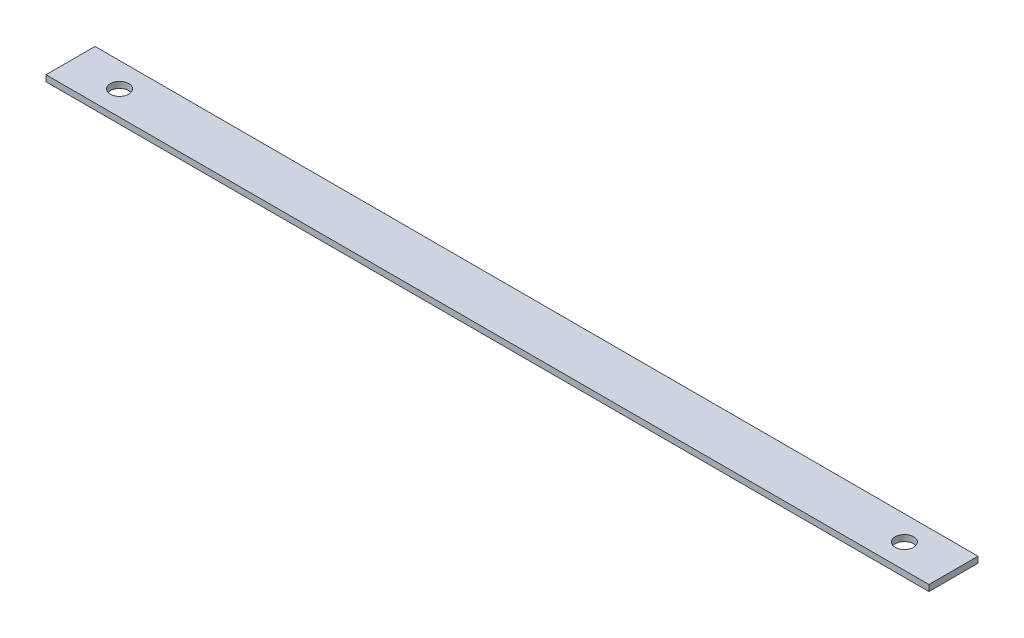
ISO-10303-21;
HEADER;
FILE_DESCRIPTION(('STEP AP214'),'2;1');
FILE_NAME('part.step','',(''),(''),'','','');
FILE_SCHEMA(('AUTOMOTIVE_DESIGN { 1 0 10303 214 1 1 1 1 }'));
ENDSEC;
DATA;
#1=APPLICATION_CONTEXT('core data for automotive mechanical design processes');
#2=APPLICATION_PROTOCOL_DEFINITION('international standard','automotive_design',2000,#1);
#3=PRODUCT_CONTEXT('',#1,'mechanical');
#4=PRODUCT('Part','Part','',(#3));
#5=PRODUCT_RELATED_PRODUCT_CATEGORY('part','',(#4));
#6=PRODUCT_DEFINITION_FORMATION('','',#4);
#7=PRODUCT_DEFINITION_CONTEXT('part definition',#1,'design');
#8=PRODUCT_DEFINITION('design','',#6,#7);
#9=PRODUCT_DEFINITION_SHAPE('','',#8);
#10=(LENGTH_UNIT() NAMED_UNIT(*) SI_UNIT(.MILLI.,.METRE.));
#11=(NAMED_UNIT(*) PLANE_ANGLE_UNIT() SI_UNIT($,.RADIAN.));
#12=(NAMED_UNIT(*) SI_UNIT($,.STERADIAN.) SOLID_ANGLE_UNIT());
#13=UNCERTAINTY_MEASURE_WITH_UNIT(LENGTH_MEASURE(1.E-05),#10,'distance_accuracy_value','');
#14=(GEOMETRIC_REPRESENTATION_CONTEXT(3) GLOBAL_UNCERTAINTY_ASSIGNED_CONTEXT((#13)) GLOBAL_UNIT_ASSIGNED_CONTEXT((#10,
#11,#12)) REPRESENTATION_CONTEXT('',''));
#15=CARTESIAN_POINT('',(0.,0.,0.));
#16=DIRECTION('',(0.,0.,1.));
#17=DIRECTION('',(1.,0.,0.));
#18=AXIS2_PLACEMENT_3D('',#15,#16,#17);
#19=CARTESIAN_POINT('',(-228.6,3.175,12.7));
#20=DIRECTION('',(1.,0.,0.));
#21=DIRECTION('',(0.,0.,-1.));
#22=AXIS2_PLACEMENT_3D('',#19,#20,#21);
#23=PLANE('',#22);
#24=DIRECTION('',(0.,0.,1.));
#25=VECTOR('',#24,1.);
#26=CARTESIAN_POINT('',(-228.6,0.,12.7));
#27=LINE('',#26,#25);
#28=CARTESIAN_POINT('',(-228.6,0.,-12.7));
#29=VERTEX_POINT('',#28);
#30=CARTESIAN_POINT('',(-228.6,0.,12.7));
#31=VERTEX_POINT('',#30);
#32=EDGE_CURVE('E99',#29,#31,#27,.T.);
#33=ORIENTED_EDGE('',*,*,#32,.T.);
#34=DIRECTION('',(0.,-1.,0.));
#35=VECTOR('',#34,1.);
#36=CARTESIAN_POINT('',(-228.6,3.175,12.7));
#37=LINE('',#36,#35);
#38=CARTESIAN_POINT('',(-228.6,3.175,12.7));
#39=VERTEX_POINT('',#38);
#40=EDGE_CURVE('E11',#39,#31,#37,.T.);
#41=ORIENTED_EDGE('',*,*,#40,.F.);
#42=DIRECTION('',(0.,0.,1.));
#43=VECTOR('',#42,1.);
#44=CARTESIAN_POINT('',(-228.6,3.175,12.7));
#45=LINE('',#44,#43);
#46=CARTESIAN_POINT('',(-228.6,3.175,-12.7));
#47=VERTEX_POINT('',#46);
#48=EDGE_CURVE('E87',#47,#39,#45,.T.);
#49=ORIENTED_EDGE('',*,*,#48,.F.);
#50=DIRECTION('',(0.,-1.,0.));
#51=VECTOR('',#50,1.);
#52=CARTESIAN_POINT('',(-228.6,3.175,-12.7));
#53=LINE('',#52,#51);
#54=EDGE_CURVE('E95',#47,#29,#53,.T.);
#55=ORIENTED_EDGE('',*,*,#54,.T.);
#56=EDGE_LOOP('',(#33,#41,#49,#55));
#57=FACE_BOUND('',#56,.T.);
#58=ADVANCED_FACE('F36',(#57),#23,.F.);
#59=CARTESIAN_POINT('',(228.6,3.175,12.7));
#60=DIRECTION('',(0.,0.,-1.));
#61=DIRECTION('',(-1.,0.,0.));
#62=AXIS2_PLACEMENT_3D('',#59,#60,#61);
#63=PLANE('',#62);
#64=DIRECTION('',(1.,0.,0.));
#65=VECTOR('',#64,1.);
#66=CARTESIAN_POINT('',(228.6,0.,12.7));
#67=LINE('',#66,#65);
#68=CARTESIAN_POINT('',(228.6,0.,12.7));
#69=VERTEX_POINT('',#68);
#70=EDGE_CURVE('E91',#31,#69,#67,.T.);
#71=ORIENTED_EDGE('',*,*,#70,.T.);
#72=DIRECTION('',(0.,-1.,0.));
#73=VECTOR('',#72,1.);
#74=CARTESIAN_POINT('',(228.6,3.175,12.7));
#75=LINE('',#74,#73);
#76=CARTESIAN_POINT('',(228.6,3.175,12.7));
#77=VERTEX_POINT('',#76);
#78=EDGE_CURVE('E44',#77,#69,#75,.T.);
#79=ORIENTED_EDGE('',*,*,#78,.F.);
#80=DIRECTION('',(1.,0.,0.));
#81=VECTOR('',#80,1.);
#82=CARTESIAN_POINT('',(228.6,3.175,12.7));
#83=LINE('',#82,#81);
#84=EDGE_CURVE('E82',#39,#77,#83,.T.);
#85=ORIENTED_EDGE('',*,*,#84,.F.);
#86=ORIENTED_EDGE('',*,*,#40,.T.);
#87=EDGE_LOOP('',(#71,#79,#85,#86));
#88=FACE_BOUND('',#87,.T.);
#89=ADVANCED_FACE('F90',(#88),#63,.F.);
#90=CARTESIAN_POINT('',(228.6,3.175,12.7));
#91=DIRECTION('',(-1.,0.,0.));
#92=DIRECTION('',(0.,0.,1.));
#93=AXIS2_PLACEMENT_3D('',#90,#91,#92);
#94=PLANE('',#93);
#95=DIRECTION('',(0.,0.,-1.));
#96=VECTOR('',#95,1.);
#97=CARTESIAN_POINT('',(228.6,0.,12.7));
#98=LINE('',#97,#96);
#99=CARTESIAN_POINT('',(228.6,0.,-12.7));
#100=VERTEX_POINT('',#99);
#101=EDGE_CURVE('E69',#69,#100,#98,.T.);
#102=ORIENTED_EDGE('',*,*,#101,.T.);
#103=DIRECTION('',(0.,-1.,0.));
#104=VECTOR('',#103,1.);
#105=CARTESIAN_POINT('',(228.6,3.175,-12.7));
#106=LINE('',#105,#104);
#107=CARTESIAN_POINT('',(228.6,3.175,-12.7));
#108=VERTEX_POINT('',#107);
#109=EDGE_CURVE('E92',#108,#100,#106,.T.);
#110=ORIENTED_EDGE('',*,*,#109,.F.);
#111=DIRECTION('',(0.,0.,-1.));
#112=VECTOR('',#111,1.);
#113=CARTESIAN_POINT('',(228.6,3.175,12.7));
#114=LINE('',#113,#112);
#115=EDGE_CURVE('E85',#77,#108,#114,.T.);
#116=ORIENTED_EDGE('',*,*,#115,.F.);
#117=ORIENTED_EDGE('',*,*,#78,.T.);
#118=EDGE_LOOP('',(#102,#110,#116,#117));
#119=FACE_BOUND('',#118,.T.);
#120=ADVANCED_FACE('F93',(#119),#94,.F.);
#121=CARTESIAN_POINT('',(228.6,3.175,-12.7));
#122=DIRECTION('',(0.,0.,1.));
#123=DIRECTION('',(1.,0.,0.));
#124=AXIS2_PLACEMENT_3D('',#121,#122,#123);
#125=PLANE('',#124);
#126=DIRECTION('',(-1.,0.,0.));
#127=VECTOR('',#126,1.);
#128=CARTESIAN_POINT('',(228.6,0.,-12.7));
#129=LINE('',#128,#127);
#130=EDGE_CURVE('E75',#100,#29,#129,.T.);
#131=ORIENTED_EDGE('',*,*,#130,.T.);
#132=ORIENTED_EDGE('',*,*,#54,.F.);
#133=DIRECTION('',(-1.,0.,0.));
#134=VECTOR('',#133,1.);
#135=CARTESIAN_POINT('',(228.6,3.175,-12.7));
#136=LINE('',#135,#134);
#137=EDGE_CURVE('E52',#108,#47,#136,.T.);
#138=ORIENTED_EDGE('',*,*,#137,.F.);
#139=ORIENTED_EDGE('',*,*,#109,.T.);
#140=EDGE_LOOP('',(#131,#132,#138,#139));
#141=FACE_BOUND('',#140,.T.);
#142=ADVANCED_FACE('F107',(#141),#125,.F.);
#143=CARTESIAN_POINT('',(0.,3.175,0.));
#144=DIRECTION('',(0.,1.,0.));
#145=DIRECTION('',(0.,0.,1.));
#146=AXIS2_PLACEMENT_3D('',#143,#144,#145);
#147=PLANE('',#146);
#148=CARTESIAN_POINT('',(-203.2,3.175,0.));
#149=DIRECTION('',(0.,1.,0.));
#150=DIRECTION('',(0.,0.,1.));
#151=AXIS2_PLACEMENT_3D('',#148,#149,#150);
#152=CIRCLE('',#151,4.76250000000001);
#153=CARTESIAN_POINT('',(-203.2,3.175,4.76250000000006));
#154=VERTEX_POINT('',#153);
#155=EDGE_CURVE('E119',#154,#154,#152,.T.);
#156=ORIENTED_EDGE('',*,*,#155,.F.);
#157=EDGE_LOOP('',(#156));
#158=FACE_BOUND('',#157,.T.);
#159=CARTESIAN_POINT('',(203.2,3.175,0.));
#160=DIRECTION('',(0.,1.,0.));
#161=DIRECTION('',(0.,0.,-1.));
#162=AXIS2_PLACEMENT_3D('',#159,#160,#161);
#163=CIRCLE('',#162,4.76250000000001);
#164=CARTESIAN_POINT('',(203.2,3.175,-4.76250000000001));
#165=VERTEX_POINT('',#164);
#166=EDGE_CURVE('E113',#165,#165,#163,.T.);
#167=ORIENTED_EDGE('',*,*,#166,.F.);
#168=EDGE_LOOP('',(#167));
#169=FACE_BOUND('',#168,.T.);
#170=ORIENTED_EDGE('',*,*,#48,.T.);
#171=ORIENTED_EDGE('',*,*,#84,.T.);
#172=ORIENTED_EDGE('',*,*,#115,.T.);
#173=ORIENTED_EDGE('',*,*,#137,.T.);
#174=EDGE_LOOP('',(#170,#171,#172,#173));
#175=FACE_BOUND('',#174,.T.);
#176=ADVANCED_FACE('F83',(#158,#169,#175),#147,.T.);
#177=CARTESIAN_POINT('',(0.,0.,0.));
#178=DIRECTION('',(0.,1.,0.));
#179=DIRECTION('',(0.,0.,1.));
#180=AXIS2_PLACEMENT_3D('',#177,#178,#179);
#181=PLANE('',#180);
#182=CARTESIAN_POINT('',(-203.2,0.,0.));
#183=DIRECTION('',(0.,1.,0.));
#184=DIRECTION('',(0.,0.,1.));
#185=AXIS2_PLACEMENT_3D('',#182,#183,#184);
#186=CIRCLE('',#185,4.76250000000001);
#187=CARTESIAN_POINT('',(-203.2,0.,4.76250000000006));
#188=VERTEX_POINT('',#187);
#189=EDGE_CURVE('E102',#188,#188,#186,.T.);
#190=ORIENTED_EDGE('',*,*,#189,.T.);
#191=EDGE_LOOP('',(#190));
#192=FACE_BOUND('',#191,.T.);
#193=CARTESIAN_POINT('',(203.2,0.,0.));
#194=DIRECTION('',(0.,1.,0.));
#195=DIRECTION('',(0.,0.,-1.));
#196=AXIS2_PLACEMENT_3D('',#193,#194,#195);
#197=CIRCLE('',#196,4.76250000000001);
#198=CARTESIAN_POINT('',(203.2,0.,-4.76250000000001));
#199=VERTEX_POINT('',#198);
#200=EDGE_CURVE('E116',#199,#199,#197,.T.);
#201=ORIENTED_EDGE('',*,*,#200,.T.);
#202=EDGE_LOOP('',(#201));
#203=FACE_BOUND('',#202,.T.);
#204=ORIENTED_EDGE('',*,*,#32,.F.);
#205=ORIENTED_EDGE('',*,*,#130,.F.);
#206=ORIENTED_EDGE('',*,*,#101,.F.);
#207=ORIENTED_EDGE('',*,*,#70,.F.);
#208=EDGE_LOOP('',(#204,#205,#206,#207));
#209=FACE_BOUND('',#208,.T.);
#210=ADVANCED_FACE('F110',(#192,#203,#209),#181,.F.);
#211=CARTESIAN_POINT('',(203.2,0.,0.));
#212=DIRECTION('',(0.,1.,0.));
#213=DIRECTION('',(0.,0.,1.));
#214=AXIS2_PLACEMENT_3D('',#211,#212,#213);
#215=CYLINDRICAL_SURFACE('',#214,4.76250000000001);
#216=ORIENTED_EDGE('',*,*,#200,.F.);
#217=EDGE_LOOP('',(#216));
#218=FACE_BOUND('',#217,.T.);
#219=ORIENTED_EDGE('',*,*,#166,.T.);
#220=EDGE_LOOP('',(#219));
#221=FACE_BOUND('',#220,.T.);
#222=ADVANCED_FACE('F130',(#218,#221),#215,.F.);
#223=CARTESIAN_POINT('',(-203.2,0.,0.));
#224=DIRECTION('',(0.,1.,0.));
#225=DIRECTION('',(0.,0.,1.));
#226=AXIS2_PLACEMENT_3D('',#223,#224,#225);
#227=CYLINDRICAL_SURFACE('',#226,4.76250000000001);
#228=ORIENTED_EDGE('',*,*,#189,.F.);
#229=EDGE_LOOP('',(#228));
#230=FACE_BOUND('',#229,.T.);
#231=ORIENTED_EDGE('',*,*,#155,.T.);
#232=EDGE_LOOP('',(#231));
#233=FACE_BOUND('',#232,.T.);
#234=ADVANCED_FACE('F127',(#230,#233),#227,.F.);
#235=CLOSED_SHELL('',(#58,#89,#120,#142,#176,#210,#222,#234));
#236=MANIFOLD_SOLID_BREP('B2',#235);
#237=ADVANCED_BREP_SHAPE_REPRESENTATION('',(#18,#236),#14);
#238=SHAPE_DEFINITION_REPRESENTATION(#9,#237);
ENDSEC;
END-ISO-10303-21;
